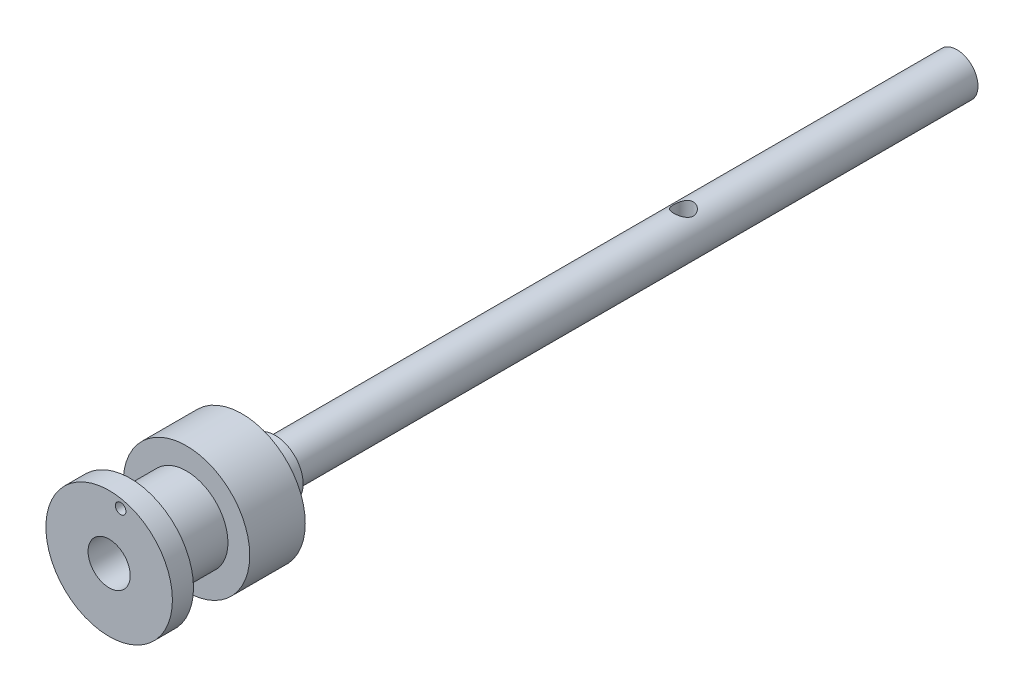
ISO-10303-21;
HEADER;
FILE_DESCRIPTION(('STEP AP214'),'2;1');
FILE_NAME('part.step','',(''),(''),'','','');
FILE_SCHEMA(('AUTOMOTIVE_DESIGN { 1 0 10303 214 1 1 1 1 }'));
ENDSEC;
DATA;
#1=APPLICATION_CONTEXT('core data for automotive mechanical design processes');
#2=APPLICATION_PROTOCOL_DEFINITION('international standard','automotive_design',2000,#1);
#3=PRODUCT_CONTEXT('',#1,'mechanical');
#4=PRODUCT('Part','Part','',(#3));
#5=PRODUCT_RELATED_PRODUCT_CATEGORY('part','',(#4));
#6=PRODUCT_DEFINITION_FORMATION('','',#4);
#7=PRODUCT_DEFINITION_CONTEXT('part definition',#1,'design');
#8=PRODUCT_DEFINITION('design','',#6,#7);
#9=PRODUCT_DEFINITION_SHAPE('','',#8);
#10=(LENGTH_UNIT() NAMED_UNIT(*) SI_UNIT(.MILLI.,.METRE.));
#11=(NAMED_UNIT(*) PLANE_ANGLE_UNIT() SI_UNIT($,.RADIAN.));
#12=(NAMED_UNIT(*) SI_UNIT($,.STERADIAN.) SOLID_ANGLE_UNIT());
#13=UNCERTAINTY_MEASURE_WITH_UNIT(LENGTH_MEASURE(1.E-05),#10,'distance_accuracy_value','');
#14=(GEOMETRIC_REPRESENTATION_CONTEXT(3) GLOBAL_UNCERTAINTY_ASSIGNED_CONTEXT((#13)) GLOBAL_UNIT_ASSIGNED_CONTEXT((#10,
#11,#12)) REPRESENTATION_CONTEXT('',''));
#15=CARTESIAN_POINT('',(0.,0.,0.));
#16=DIRECTION('',(0.,0.,1.));
#17=DIRECTION('',(1.,0.,0.));
#18=AXIS2_PLACEMENT_3D('',#15,#16,#17);
#19=CARTESIAN_POINT('',(0.,0.,97.));
#20=DIRECTION('',(0.,0.,-1.));
#21=DIRECTION('',(-1.,0.,0.));
#22=AXIS2_PLACEMENT_3D('',#19,#20,#21);
#23=CYLINDRICAL_SURFACE('',#22,3.);
#24=CARTESIAN_POINT('',(0.,-3.00000000000001,37.5));
#25=CARTESIAN_POINT('',(0.0741760141958577,-2.99999659855673,37.5000040505541));
#26=CARTESIAN_POINT('',(0.148457438343162,-2.99721866421499,37.5059298208353));
#27=CARTESIAN_POINT('',(0.294860958042644,-2.98638133101226,37.5293877592733));
#28=CARTESIAN_POINT('',(0.366977899485668,-2.97831023303416,37.546945637961));
#29=CARTESIAN_POINT('',(0.506705207958361,-2.95773878056305,37.5928517551339));
#30=CARTESIAN_POINT('',(0.574331184032733,-2.94525483671525,37.6211600432343));
#31=CARTESIAN_POINT('',(0.703790652559763,-2.91703179641225,37.6875743006987));
#32=CARTESIAN_POINT('',(0.765625113804215,-2.90129324579851,37.7256786273952));
#33=CARTESIAN_POINT('',(0.885556018232688,-2.86703510505486,37.8129906836775));
#34=CARTESIAN_POINT('',(0.943262854198603,-2.84841047078529,37.8626918392666));
#35=CARTESIAN_POINT('',(1.04987206669059,-2.81086626705385,37.9707341871541));
#36=CARTESIAN_POINT('',(1.09876864666267,-2.79194651225135,38.0290810220613));
#37=CARTESIAN_POINT('',(1.18954928643586,-2.75454886272565,38.1573436722992));
#38=CARTESIAN_POINT('',(1.23076801131512,-2.73618026181932,38.2277658265075));
#39=CARTESIAN_POINT('',(1.30060459631542,-2.70368671328043,38.3755083341662));
#40=CARTESIAN_POINT('',(1.32923050054668,-2.68955905843085,38.452824245907));
#41=CARTESIAN_POINT('',(1.37136389166293,-2.66831280778357,38.6077086691858));
#42=CARTESIAN_POINT('',(1.38562630954339,-2.66084688805231,38.6850220133979));
#43=CARTESIAN_POINT('',(1.40096431780121,-2.65280653141493,38.8412761554687));
#44=CARTESIAN_POINT('',(1.40205018901381,-2.65222672171534,38.9202156363732));
#45=CARTESIAN_POINT('',(1.39156325474428,-2.6577381391041,39.0689521774073));
#46=CARTESIAN_POINT('',(1.381255487101,-2.66316277668237,39.1388686763252));
#47=CARTESIAN_POINT('',(1.35043639237287,-2.67892103840313,39.2758340783928));
#48=CARTESIAN_POINT('',(1.3299224430034,-2.68925592410991,39.3428822397673));
#49=CARTESIAN_POINT('',(1.27887161255288,-2.71390923378543,39.4740721913311));
#50=CARTESIAN_POINT('',(1.24811450695909,-2.7283140240837,39.5381113040015));
#51=CARTESIAN_POINT('',(1.17761205733664,-2.75947702819645,39.6604059963507));
#52=CARTESIAN_POINT('',(1.1378627854815,-2.77623626923161,39.7186590325906));
#53=CARTESIAN_POINT('',(1.04545769592097,-2.81242518177221,39.8343867427587));
#54=CARTESIAN_POINT('',(0.991869135627395,-2.83194722846672,39.8910901886705));
#55=CARTESIAN_POINT('',(0.875809338201013,-2.86996272516677,39.9950011611005));
#56=CARTESIAN_POINT('',(0.813334864133959,-2.88845579691006,40.0422052120085));
#57=CARTESIAN_POINT('',(0.678420066791924,-2.92314231667083,40.1273252580099));
#58=CARTESIAN_POINT('',(0.605704043903023,-2.9392303997136,40.1648505604658));
#59=CARTESIAN_POINT('',(0.454047875045118,-2.9664385628126,40.2268527185111));
#60=CARTESIAN_POINT('',(0.375112098848916,-2.97756209480586,40.2513386428982));
#61=CARTESIAN_POINT('',(0.219630179590074,-2.99289168727817,40.2847753854863));
#62=CARTESIAN_POINT('',(0.143350867486899,-2.99755511855446,40.2947561577534));
#63=CARTESIAN_POINT('',(-0.00993159603061788,-3.00096130674055,40.3020633399195));
#64=CARTESIAN_POINT('',(-0.0869344549309973,-2.99970636153703,40.2993946611306));
#65=CARTESIAN_POINT('',(-0.23413866230114,-2.99169876992405,40.2821402277437));
#66=CARTESIAN_POINT('',(-0.304455247280257,-2.98531143610107,40.268346120726));
#67=CARTESIAN_POINT('',(-0.441661374952193,-2.9681169868393,40.2304147035299));
#68=CARTESIAN_POINT('',(-0.508550515457679,-2.95730935403884,40.2062761826025));
#69=CARTESIAN_POINT('',(-0.639346310572955,-2.93186182190092,40.1476106001117));
#70=CARTESIAN_POINT('',(-0.703098749779362,-2.91711463217098,40.1127878500144));
#71=CARTESIAN_POINT('',(-0.824081336424183,-2.88527461622476,40.034065572947));
#72=CARTESIAN_POINT('',(-0.881308600637789,-2.86818076040266,39.9901620574598));
#73=CARTESIAN_POINT('',(-0.992927203863405,-2.83157928041133,39.8900494219181));
#74=CARTESIAN_POINT('',(-1.04662821994276,-2.81199150907127,39.8330982533047));
#75=CARTESIAN_POINT('',(-1.14397488618524,-2.7738171204936,39.710822052853));
#76=CARTESIAN_POINT('',(-1.18761573536872,-2.7552309844915,39.6454930459361));
#77=CARTESIAN_POINT('',(-1.26487258942863,-2.72065279755534,39.5055462612367));
#78=CARTESIAN_POINT('',(-1.29811762077689,-2.70476441122083,39.4306959670314));
#79=CARTESIAN_POINT('',(-1.35119476914698,-2.67864935946574,39.2754739377038));
#80=CARTESIAN_POINT('',(-1.37104172650418,-2.6684164320798,39.1951084206029));
#81=CARTESIAN_POINT('',(-1.39512361569359,-2.65589863089785,39.0389244522856));
#82=CARTESIAN_POINT('',(-1.40060458275625,-2.65298045006346,38.9633491392689));
#83=CARTESIAN_POINT('',(-1.39928993042139,-2.65367487263324,38.81234617673));
#84=CARTESIAN_POINT('',(-1.39249775922279,-2.65728564169682,38.7369184916911));
#85=CARTESIAN_POINT('',(-1.36795238910771,-2.66999487603889,38.5940999375163));
#86=CARTESIAN_POINT('',(-1.35103435582631,-2.67867409395688,38.5265240407042));
#87=CARTESIAN_POINT('',(-1.30765598987226,-2.70011439829818,38.3952017153972));
#88=CARTESIAN_POINT('',(-1.28119281477063,-2.71287670048705,38.3314564342173));
#89=CARTESIAN_POINT('',(-1.21748406199402,-2.74208602331761,38.2049634549476));
#90=CARTESIAN_POINT('',(-1.1796403806501,-2.75872111955289,38.1425615223786));
#91=CARTESIAN_POINT('',(-1.0949742620724,-2.79340714138716,38.0246101855588));
#92=CARTESIAN_POINT('',(-1.04814763276814,-2.81145872568485,37.9690640006461));
#93=CARTESIAN_POINT('',(-0.94130768052003,-2.8491150891186,37.8606263800043));
#94=CARTESIAN_POINT('',(-0.880442612871032,-2.86869394428718,37.8085607412822));
#95=CARTESIAN_POINT('',(-0.750199086477076,-2.90547332461736,37.7152565671488));
#96=CARTESIAN_POINT('',(-0.680816600685454,-2.92267271652822,37.6740231823952));
#97=CARTESIAN_POINT('',(-0.535611024288787,-2.95272548252542,37.6040125020167));
#98=CARTESIAN_POINT('',(-0.459824309977943,-2.965601576783,37.5751698583364));
#99=CARTESIAN_POINT('',(-0.303822742627251,-2.98560363061672,37.5309772564507));
#100=CARTESIAN_POINT('',(-0.223621832238218,-2.99274669700571,37.5155871448256));
#101=CARTESIAN_POINT('',(-0.118989792805178,-2.99773444736986,37.5048609854243));
#102=CARTESIAN_POINT('',(-0.0952397688918326,-2.99858232619917,37.5030400999808));
#103=CARTESIAN_POINT('',(-0.0476634596251023,-2.99971565466794,37.50060894435));
#104=CARTESIAN_POINT('',(-0.023837172759726,-3.0000010930864,37.4999986983156));
#105=CARTESIAN_POINT('',(0.,-3.00000000000001,37.5));
#106=B_SPLINE_CURVE_WITH_KNOTS('',3,(#24,#25,#26,#27,#28,#29,#30,#31,#32,#33,#34,#35,#36,#37,
#38,#39,#40,#41,#42,#43,#44,#45,#46,#47,#48,#49,#50,#51,#52,#53,#54,#55,#56,#57,#58,#59,#60,#61,
#62,#63,#64,#65,#66,#67,#68,#69,#70,#71,#72,#73,#74,#75,#76,#77,#78,#79,#80,#81,#82,#83,#84,#85,
#86,#87,#88,#89,#90,#91,#92,#93,#94,#95,#96,#97,#98,#99,#100,#101,#102,#103,#104,#105),
.UNSPECIFIED.,.T.,.F.,(4,2,2,2,2,2,2,2,2,2,2,2,2,2,2,2,2,2,2,2,2,2,2,2,2,2,2,2,2,2,2,2,2,2,2,2,
2,2,2,2,4),(0.,0.222430614227102,0.445354516020346,0.6674579744595,0.889524213319487,
1.12374008349084,1.35810949364731,1.60776429290694,1.85725938392491,2.09282314699249,
2.32820310256044,2.53985531348055,2.75156193252273,2.96815060600376,3.18483406988204,
3.42504393482462,3.66534152788206,3.91419776760518,4.16288070273415,4.39285884216799,
4.62274769694934,4.83758576938905,5.05244899415581,5.27389671638204,5.49544191175845,
5.73644174754948,5.97755635787824,6.2264897623231,6.47514698203738,6.70138965858241,
6.92756878101078,7.13725924988262,7.34701221368887,7.57065894835864,7.79441030722339,
8.04061569917069,8.28693794895592,8.53194466707523,8.77621756163929,8.84769634435319,
8.91917655309539),.UNSPECIFIED.);
#107=CARTESIAN_POINT('',(0.,-3.00000000000001,37.5));
#108=VERTEX_POINT('',#107);
#109=EDGE_CURVE('E55',#108,#108,#106,.T.);
#110=ORIENTED_EDGE('',*,*,#109,.F.);
#111=EDGE_LOOP('',(#110));
#112=FACE_BOUND('',#111,.T.);
#113=CARTESIAN_POINT('',(0.,0.,97.));
#114=DIRECTION('',(0.,0.,1.));
#115=DIRECTION('',(1.,0.,0.));
#116=AXIS2_PLACEMENT_3D('',#113,#114,#115);
#117=CIRCLE('',#116,3.);
#118=CARTESIAN_POINT('',(3.,0.,97.));
#119=VERTEX_POINT('',#118);
#120=EDGE_CURVE('E10',#119,#119,#117,.T.);
#121=ORIENTED_EDGE('',*,*,#120,.F.);
#122=EDGE_LOOP('',(#121));
#123=FACE_BOUND('',#122,.T.);
#124=CARTESIAN_POINT('',(0.,0.,0.));
#125=DIRECTION('',(0.,0.,1.));
#126=DIRECTION('',(1.,0.,0.));
#127=AXIS2_PLACEMENT_3D('',#124,#125,#126);
#128=CIRCLE('',#127,3.);
#129=CARTESIAN_POINT('',(3.,0.,0.));
#130=VERTEX_POINT('',#129);
#131=EDGE_CURVE('E45',#130,#130,#128,.T.);
#132=ORIENTED_EDGE('',*,*,#131,.T.);
#133=EDGE_LOOP('',(#132));
#134=FACE_BOUND('',#133,.T.);
#135=CARTESIAN_POINT('',(0.,2.99999999999999,37.5));
#136=CARTESIAN_POINT('',(-0.0741760141958482,2.99999659855667,37.5000040505541));
#137=CARTESIAN_POINT('',(-0.148457438343153,2.99721866421498,37.5059298208353));
#138=CARTESIAN_POINT('',(-0.294860958042633,2.98638133101227,37.5293877592733));
#139=CARTESIAN_POINT('',(-0.366977899485655,2.97831023303417,37.546945637961));
#140=CARTESIAN_POINT('',(-0.506705207958345,2.95773878056305,37.5928517551339));
#141=CARTESIAN_POINT('',(-0.574331184032716,2.94525483671525,37.6211600432343));
#142=CARTESIAN_POINT('',(-0.703790652559745,2.91703179641225,37.6875743006987));
#143=CARTESIAN_POINT('',(-0.765625113804198,2.90129324579851,37.7256786273952));
#144=CARTESIAN_POINT('',(-0.88555601823267,2.86703510505487,37.8129906836775));
#145=CARTESIAN_POINT('',(-0.943262854198585,2.84841047078529,37.8626918392666));
#146=CARTESIAN_POINT('',(-1.04987206669057,2.81086626705386,37.9707341871541));
#147=CARTESIAN_POINT('',(-1.09876864666265,2.79194651225135,38.0290810220613));
#148=CARTESIAN_POINT('',(-1.18954928643584,2.75454886272566,38.1573436722992));
#149=CARTESIAN_POINT('',(-1.2307680113151,2.73618026181933,38.2277658265075));
#150=CARTESIAN_POINT('',(-1.30060459631541,2.70368671328044,38.3755083341662));
#151=CARTESIAN_POINT('',(-1.32923050054667,2.68955905843086,38.452824245907));
#152=CARTESIAN_POINT('',(-1.37136389166291,2.66831280778357,38.6077086691858));
#153=CARTESIAN_POINT('',(-1.38562630954337,2.66084688805232,38.6850220133979));
#154=CARTESIAN_POINT('',(-1.4009643178012,2.65280653141493,38.8412761554687));
#155=CARTESIAN_POINT('',(-1.4020501890138,2.65222672171534,38.9202156363732));
#156=CARTESIAN_POINT('',(-1.39156325474427,2.6577381391041,39.0689521774073));
#157=CARTESIAN_POINT('',(-1.38125548710099,2.66316277668237,39.1388686763252));
#158=CARTESIAN_POINT('',(-1.35043639237286,2.67892103840314,39.2758340783928));
#159=CARTESIAN_POINT('',(-1.32992244300339,2.68925592410991,39.3428822397672));
#160=CARTESIAN_POINT('',(-1.27887161255287,2.71390923378543,39.4740721913311));
#161=CARTESIAN_POINT('',(-1.24811450695909,2.7283140240837,39.5381113040015));
#162=CARTESIAN_POINT('',(-1.17761205733664,2.75947702819645,39.6604059963507));
#163=CARTESIAN_POINT('',(-1.13786278548148,2.77623626923161,39.7186590325906));
#164=CARTESIAN_POINT('',(-1.04545769592096,2.81242518177222,39.8343867427587));
#165=CARTESIAN_POINT('',(-0.991869135627376,2.83194722846673,39.8910901886705));
#166=CARTESIAN_POINT('',(-0.87580933820099,2.86996272516678,39.9950011611005));
#167=CARTESIAN_POINT('',(-0.813334864133935,2.88845579691007,40.0422052120086));
#168=CARTESIAN_POINT('',(-0.678420066791899,2.92314231667084,40.1273252580099));
#169=CARTESIAN_POINT('',(-0.605704043902998,2.93923039971361,40.1648505604658));
#170=CARTESIAN_POINT('',(-0.454047875045094,2.9664385628126,40.2268527185111));
#171=CARTESIAN_POINT('',(-0.375112098848894,2.97756209480586,40.2513386428982));
#172=CARTESIAN_POINT('',(-0.219630179590053,2.99289168727817,40.2847753854863));
#173=CARTESIAN_POINT('',(-0.143350867486879,2.99755511855446,40.2947561577534));
#174=CARTESIAN_POINT('',(0.00993159603063501,3.00096130674055,40.3020633399195));
#175=CARTESIAN_POINT('',(0.0869344549310127,2.99970636153703,40.2993946611306));
#176=CARTESIAN_POINT('',(0.234138662301153,2.99169876992405,40.2821402277437));
#177=CARTESIAN_POINT('',(0.304455247280268,2.98531143610107,40.268346120726));
#178=CARTESIAN_POINT('',(0.441661374952202,2.9681169868393,40.2304147035299));
#179=CARTESIAN_POINT('',(0.508550515457686,2.95730935403884,40.2062761826025));
#180=CARTESIAN_POINT('',(0.639346310572961,2.93186182190092,40.1476106001117));
#181=CARTESIAN_POINT('',(0.703098749779369,2.91711463217098,40.1127878500144));
#182=CARTESIAN_POINT('',(0.824081336424188,2.88527461622476,40.034065572947));
#183=CARTESIAN_POINT('',(0.881308600637791,2.86818076040266,39.9901620574598));
#184=CARTESIAN_POINT('',(0.992927203863406,2.83157928041133,39.8900494219181));
#185=CARTESIAN_POINT('',(1.04662821994276,2.81199150907127,39.8330982533047));
#186=CARTESIAN_POINT('',(1.14397488618524,2.7738171204936,39.7108220528531));
#187=CARTESIAN_POINT('',(1.18761573536873,2.7552309844915,39.6454930459362));
#188=CARTESIAN_POINT('',(1.26487258942864,2.72065279755534,39.5055462612367));
#189=CARTESIAN_POINT('',(1.2981176207769,2.70476441122083,39.4306959670314));
#190=CARTESIAN_POINT('',(1.35119476914698,2.67864935946574,39.2754739377038));
#191=CARTESIAN_POINT('',(1.37104172650419,2.6684164320798,39.195108420603));
#192=CARTESIAN_POINT('',(1.39512361569359,2.65589863089785,39.0389244522856));
#193=CARTESIAN_POINT('',(1.40060458275626,2.65298045006346,38.9633491392689));
#194=CARTESIAN_POINT('',(1.3992899304214,2.65367487263323,38.81234617673));
#195=CARTESIAN_POINT('',(1.3924977592228,2.65728564169681,38.7369184916911));
#196=CARTESIAN_POINT('',(1.36795238910772,2.66999487603889,38.5940999375163));
#197=CARTESIAN_POINT('',(1.35103435582632,2.67867409395687,38.5265240407042));
#198=CARTESIAN_POINT('',(1.30765598987227,2.70011439829818,38.3952017153972));
#199=CARTESIAN_POINT('',(1.28119281477064,2.71287670048704,38.3314564342173));
#200=CARTESIAN_POINT('',(1.21748406199402,2.7420860233176,38.2049634549476));
#201=CARTESIAN_POINT('',(1.1796403806501,2.75872111955289,38.1425615223786));
#202=CARTESIAN_POINT('',(1.09497426207241,2.79340714138716,38.0246101855587));
#203=CARTESIAN_POINT('',(1.04814763276814,2.81145872568485,37.9690640006461));
#204=CARTESIAN_POINT('',(0.941307680520032,2.8491150891186,37.8606263800043));
#205=CARTESIAN_POINT('',(0.880442612871032,2.86869394428718,37.8085607412822));
#206=CARTESIAN_POINT('',(0.750199086477077,2.90547332461736,37.7152565671488));
#207=CARTESIAN_POINT('',(0.680816600685457,2.92267271652822,37.6740231823952));
#208=CARTESIAN_POINT('',(0.535611024288791,2.95272548252542,37.6040125020167));
#209=CARTESIAN_POINT('',(0.459824309977945,2.96560157678301,37.5751698583364));
#210=CARTESIAN_POINT('',(0.303822742627251,2.98560363061671,37.5309772564507));
#211=CARTESIAN_POINT('',(0.223621832238217,2.99274669700571,37.5155871448256));
#212=CARTESIAN_POINT('',(0.118989792805178,2.99773444736987,37.5048609854243));
#213=CARTESIAN_POINT('',(0.0952397688918344,2.99858232619917,37.5030400999808));
#214=CARTESIAN_POINT('',(0.0476634596251078,2.99971565466793,37.50060894435));
#215=CARTESIAN_POINT('',(0.0238371727597335,3.00000109308638,37.4999986983156));
#216=CARTESIAN_POINT('',(0.,2.99999999999999,37.5));
#217=B_SPLINE_CURVE_WITH_KNOTS('',3,(#135,#136,#137,#138,#139,#140,#141,#142,#143,#144,#145,
#146,#147,#148,#149,#150,#151,#152,#153,#154,#155,#156,#157,#158,#159,#160,#161,#162,#163,#164,
#165,#166,#167,#168,#169,#170,#171,#172,#173,#174,#175,#176,#177,#178,#179,#180,#181,#182,#183,
#184,#185,#186,#187,#188,#189,#190,#191,#192,#193,#194,#195,#196,#197,#198,#199,#200,#201,#202,
#203,#204,#205,#206,#207,#208,#209,#210,#211,#212,#213,#214,#215,#216),.UNSPECIFIED.,.T.,.F.,(4,
2,2,2,2,2,2,2,2,2,2,2,2,2,2,2,2,2,2,2,2,2,2,2,2,2,2,2,2,2,2,2,2,2,2,2,2,2,2,2,4),(0.,
0.222430614227101,0.44535451602034,0.667457974459488,0.889524213319475,1.12374008349083,
1.35810949364729,1.60776429290693,1.85725938392489,2.09282314699247,2.32820310256043,
2.53985531348055,2.75156193252273,2.96815060600375,3.18483406988204,3.42504393482464,
3.66534152788208,3.9141977676052,4.16288070273416,4.392858842168,4.62274769694935,
4.83758576938904,5.0524489941558,5.27389671638203,5.49544191175844,5.73644174754947,
5.97755635787823,6.22648976232309,6.47514698203736,6.7013896585824,6.92756878101077,
7.13725924988262,7.34701221368888,7.57065894835865,7.7944103072234,8.0406156991707,
8.28693794895593,8.53194466707524,8.7762175616393,8.84769634435319,8.91917655309539),.UNSPECIFIED.);
#218=CARTESIAN_POINT('',(0.,2.99999999999999,37.5));
#219=VERTEX_POINT('',#218);
#220=EDGE_CURVE('E38',#219,#219,#217,.T.);
#221=ORIENTED_EDGE('',*,*,#220,.F.);
#222=EDGE_LOOP('',(#221));
#223=FACE_BOUND('',#222,.T.);
#224=ADVANCED_FACE('F34',(#112,#123,#134,#223),#23,.T.);
#225=CARTESIAN_POINT('',(0.,0.,109.6));
#226=DIRECTION('',(0.,0.,1.));
#227=DIRECTION('',(1.,0.,0.));
#228=AXIS2_PLACEMENT_3D('',#225,#226,#227);
#229=PLANE('',#228);
#230=CARTESIAN_POINT('',(0.,0.,109.6));
#231=DIRECTION('',(0.,0.,1.));
#232=DIRECTION('',(1.,0.,0.));
#233=AXIS2_PLACEMENT_3D('',#230,#231,#232);
#234=CIRCLE('',#233,9.);
#235=CARTESIAN_POINT('',(9.,0.,109.6));
#236=VERTEX_POINT('',#235);
#237=EDGE_CURVE('E138',#236,#236,#234,.T.);
#238=ORIENTED_EDGE('',*,*,#237,.T.);
#239=EDGE_LOOP('',(#238));
#240=FACE_BOUND('',#239,.T.);
#241=CARTESIAN_POINT('',(0.,0.,109.6));
#242=DIRECTION('',(0.,0.,1.));
#243=DIRECTION('',(1.,0.,0.));
#244=AXIS2_PLACEMENT_3D('',#241,#242,#243);
#245=CIRCLE('',#244,5.9);
#246=CARTESIAN_POINT('',(5.9,0.,109.6));
#247=VERTEX_POINT('',#246);
#248=EDGE_CURVE('E128',#247,#247,#245,.T.);
#249=ORIENTED_EDGE('',*,*,#248,.F.);
#250=EDGE_LOOP('',(#249));
#251=FACE_BOUND('',#250,.T.);
#252=ADVANCED_FACE('F86',(#240,#251),#229,.T.);
#253=CARTESIAN_POINT('',(0.,0.,0.));
#254=DIRECTION('',(0.,0.,1.));
#255=DIRECTION('',(1.,0.,0.));
#256=AXIS2_PLACEMENT_3D('',#253,#254,#255);
#257=PLANE('',#256);
#258=ORIENTED_EDGE('',*,*,#131,.F.);
#259=EDGE_LOOP('',(#258));
#260=FACE_BOUND('',#259,.T.);
#261=ADVANCED_FACE('F89',(#260),#257,.F.);
#262=CARTESIAN_POINT('',(0.,0.,97.));
#263=DIRECTION('',(0.,0.,1.));
#264=DIRECTION('',(1.,0.,0.));
#265=AXIS2_PLACEMENT_3D('',#262,#263,#264);
#266=PLANE('',#265);
#267=CARTESIAN_POINT('',(0.,0.,97.));
#268=DIRECTION('',(0.,0.,1.));
#269=DIRECTION('',(1.,0.,0.));
#270=AXIS2_PLACEMENT_3D('',#267,#268,#269);
#271=CIRCLE('',#270,4.);
#272=CARTESIAN_POINT('',(4.,0.,97.));
#273=VERTEX_POINT('',#272);
#274=EDGE_CURVE('E53',#273,#273,#271,.T.);
#275=ORIENTED_EDGE('',*,*,#274,.F.);
#276=EDGE_LOOP('',(#275));
#277=FACE_BOUND('',#276,.T.);
#278=ORIENTED_EDGE('',*,*,#120,.T.);
#279=EDGE_LOOP('',(#278));
#280=FACE_BOUND('',#279,.T.);
#281=ADVANCED_FACE('F99',(#277,#280),#266,.F.);
#282=CARTESIAN_POINT('',(0.,0.,101.7));
#283=DIRECTION('',(0.,0.,-1.));
#284=DIRECTION('',(-1.,0.,0.));
#285=AXIS2_PLACEMENT_3D('',#282,#283,#284);
#286=CYLINDRICAL_SURFACE('',#285,4.);
#287=CARTESIAN_POINT('',(0.,0.,101.7));
#288=DIRECTION('',(0.,0.,1.));
#289=DIRECTION('',(1.,0.,0.));
#290=AXIS2_PLACEMENT_3D('',#287,#288,#289);
#291=CIRCLE('',#290,4.);
#292=CARTESIAN_POINT('',(4.,0.,101.7));
#293=VERTEX_POINT('',#292);
#294=EDGE_CURVE('E50',#293,#293,#291,.T.);
#295=ORIENTED_EDGE('',*,*,#294,.F.);
#296=EDGE_LOOP('',(#295));
#297=FACE_BOUND('',#296,.T.);
#298=ORIENTED_EDGE('',*,*,#274,.T.);
#299=EDGE_LOOP('',(#298));
#300=FACE_BOUND('',#299,.T.);
#301=ADVANCED_FACE('F94',(#297,#300),#286,.T.);
#302=CARTESIAN_POINT('',(0.,0.,101.7));
#303=DIRECTION('',(0.,0.,1.));
#304=DIRECTION('',(1.,0.,0.));
#305=AXIS2_PLACEMENT_3D('',#302,#303,#304);
#306=PLANE('',#305);
#307=CARTESIAN_POINT('',(0.,0.,101.7));
#308=DIRECTION('',(0.,0.,1.));
#309=DIRECTION('',(1.,0.,0.));
#310=AXIS2_PLACEMENT_3D('',#307,#308,#309);
#311=CIRCLE('',#310,9.);
#312=CARTESIAN_POINT('',(9.,0.,101.7));
#313=VERTEX_POINT('',#312);
#314=EDGE_CURVE('E135',#313,#313,#311,.T.);
#315=ORIENTED_EDGE('',*,*,#314,.F.);
#316=EDGE_LOOP('',(#315));
#317=FACE_BOUND('',#316,.T.);
#318=ORIENTED_EDGE('',*,*,#294,.T.);
#319=EDGE_LOOP('',(#318));
#320=FACE_BOUND('',#319,.T.);
#321=ADVANCED_FACE('F91',(#317,#320),#306,.F.);
#322=CARTESIAN_POINT('',(0.,0.,109.6));
#323=DIRECTION('',(0.,0.,-1.));
#324=DIRECTION('',(-1.,0.,0.));
#325=AXIS2_PLACEMENT_3D('',#322,#323,#324);
#326=CYLINDRICAL_SURFACE('',#325,9.);
#327=ORIENTED_EDGE('',*,*,#237,.F.);
#328=EDGE_LOOP('',(#327));
#329=FACE_BOUND('',#328,.T.);
#330=ORIENTED_EDGE('',*,*,#314,.T.);
#331=EDGE_LOOP('',(#330));
#332=FACE_BOUND('',#331,.T.);
#333=ADVANCED_FACE('F84',(#329,#332),#326,.T.);
#334=CARTESIAN_POINT('',(0.,0.,117.6));
#335=DIRECTION('',(0.,0.,-1.));
#336=DIRECTION('',(-1.,0.,0.));
#337=AXIS2_PLACEMENT_3D('',#334,#335,#336);
#338=CYLINDRICAL_SURFACE('',#337,5.9);
#339=CARTESIAN_POINT('',(0.,0.,117.6));
#340=DIRECTION('',(0.,0.,1.));
#341=DIRECTION('',(1.,0.,0.));
#342=AXIS2_PLACEMENT_3D('',#339,#340,#341);
#343=CIRCLE('',#342,5.9);
#344=CARTESIAN_POINT('',(5.9,0.,117.6));
#345=VERTEX_POINT('',#344);
#346=EDGE_CURVE('E132',#345,#345,#343,.T.);
#347=ORIENTED_EDGE('',*,*,#346,.F.);
#348=EDGE_LOOP('',(#347));
#349=FACE_BOUND('',#348,.T.);
#350=ORIENTED_EDGE('',*,*,#248,.T.);
#351=EDGE_LOOP('',(#350));
#352=FACE_BOUND('',#351,.T.);
#353=ADVANCED_FACE('F77',(#349,#352),#338,.T.);
#354=CARTESIAN_POINT('',(0.,0.,117.6));
#355=DIRECTION('',(0.,0.,1.));
#356=DIRECTION('',(1.,0.,0.));
#357=AXIS2_PLACEMENT_3D('',#354,#355,#356);
#358=PLANE('',#357);
#359=CARTESIAN_POINT('',(1.63775133757756,7.5882478641098,117.6));
#360=DIRECTION('',(0.,0.,1.));
#361=DIRECTION('',(1.,0.,0.));
#362=AXIS2_PLACEMENT_3D('',#359,#360,#361);
#363=CIRCLE('',#362,0.75);
#364=CARTESIAN_POINT('',(2.38775133757756,7.5882478641098,117.6));
#365=VERTEX_POINT('',#364);
#366=EDGE_CURVE('E159',#365,#365,#363,.T.);
#367=ORIENTED_EDGE('',*,*,#366,.T.);
#368=EDGE_LOOP('',(#367));
#369=FACE_BOUND('',#368,.T.);
#370=CARTESIAN_POINT('',(0.,0.,117.6));
#371=DIRECTION('',(0.,0.,1.));
#372=DIRECTION('',(1.,0.,0.));
#373=AXIS2_PLACEMENT_3D('',#370,#371,#372);
#374=CIRCLE('',#373,9.);
#375=CARTESIAN_POINT('',(9.,0.,117.6));
#376=VERTEX_POINT('',#375);
#377=EDGE_CURVE('E121',#376,#376,#374,.T.);
#378=ORIENTED_EDGE('',*,*,#377,.F.);
#379=EDGE_LOOP('',(#378));
#380=FACE_BOUND('',#379,.T.);
#381=ORIENTED_EDGE('',*,*,#346,.T.);
#382=EDGE_LOOP('',(#381));
#383=FACE_BOUND('',#382,.T.);
#384=ADVANCED_FACE('F74',(#369,#380,#383),#358,.F.);
#385=CARTESIAN_POINT('',(0.,0.,120.6));
#386=DIRECTION('',(0.,0.,-1.));
#387=DIRECTION('',(-1.,0.,0.));
#388=AXIS2_PLACEMENT_3D('',#385,#386,#387);
#389=CYLINDRICAL_SURFACE('',#388,9.);
#390=CARTESIAN_POINT('',(0.,0.,120.6));
#391=DIRECTION('',(0.,0.,1.));
#392=DIRECTION('',(1.,0.,0.));
#393=AXIS2_PLACEMENT_3D('',#390,#391,#392);
#394=CIRCLE('',#393,9.);
#395=CARTESIAN_POINT('',(9.,0.,120.6));
#396=VERTEX_POINT('',#395);
#397=EDGE_CURVE('E123',#396,#396,#394,.T.);
#398=ORIENTED_EDGE('',*,*,#397,.F.);
#399=EDGE_LOOP('',(#398));
#400=FACE_BOUND('',#399,.T.);
#401=ORIENTED_EDGE('',*,*,#377,.T.);
#402=EDGE_LOOP('',(#401));
#403=FACE_BOUND('',#402,.T.);
#404=ADVANCED_FACE('F72',(#400,#403),#389,.T.);
#405=CARTESIAN_POINT('',(0.,0.,120.6));
#406=DIRECTION('',(0.,0.,1.));
#407=DIRECTION('',(1.,0.,0.));
#408=AXIS2_PLACEMENT_3D('',#405,#406,#407);
#409=PLANE('',#408);
#410=CARTESIAN_POINT('',(1.63775133757756,7.5882478641098,120.6));
#411=DIRECTION('',(0.,0.,1.));
#412=DIRECTION('',(1.,0.,0.));
#413=AXIS2_PLACEMENT_3D('',#410,#411,#412);
#414=CIRCLE('',#413,0.75);
#415=CARTESIAN_POINT('',(2.38775133757756,7.5882478641098,120.6));
#416=VERTEX_POINT('',#415);
#417=EDGE_CURVE('E164',#416,#416,#414,.T.);
#418=ORIENTED_EDGE('',*,*,#417,.F.);
#419=EDGE_LOOP('',(#418));
#420=FACE_BOUND('',#419,.T.);
#421=CARTESIAN_POINT('',(0.,0.,120.6));
#422=DIRECTION('',(0.,0.,1.));
#423=DIRECTION('',(1.,0.,0.));
#424=AXIS2_PLACEMENT_3D('',#421,#422,#423);
#425=CIRCLE('',#424,3.);
#426=CARTESIAN_POINT('',(3.,0.,120.6));
#427=VERTEX_POINT('',#426);
#428=EDGE_CURVE('E156',#427,#427,#425,.T.);
#429=ORIENTED_EDGE('',*,*,#428,.F.);
#430=EDGE_LOOP('',(#429));
#431=FACE_BOUND('',#430,.T.);
#432=ORIENTED_EDGE('',*,*,#397,.T.);
#433=EDGE_LOOP('',(#432));
#434=FACE_BOUND('',#433,.T.);
#435=ADVANCED_FACE('F66',(#420,#431,#434),#409,.T.);
#436=CARTESIAN_POINT('',(0.,82.,38.9));
#437=DIRECTION('',(0.,-1.,0.));
#438=DIRECTION('',(0.,0.,-1.));
#439=AXIS2_PLACEMENT_3D('',#436,#437,#438);
#440=CYLINDRICAL_SURFACE('',#439,1.4);
#441=ORIENTED_EDGE('',*,*,#109,.T.);
#442=EDGE_LOOP('',(#441));
#443=FACE_BOUND('',#442,.T.);
#444=ORIENTED_EDGE('',*,*,#220,.T.);
#445=EDGE_LOOP('',(#444));
#446=FACE_BOUND('',#445,.T.);
#447=ADVANCED_FACE('F60',(#443,#446),#440,.F.);
#448=CARTESIAN_POINT('',(0.,0.,111.6));
#449=DIRECTION('',(0.,0.,1.));
#450=DIRECTION('',(1.,0.,0.));
#451=AXIS2_PLACEMENT_3D('',#448,#449,#450);
#452=CYLINDRICAL_SURFACE('',#451,3.);
#453=CARTESIAN_POINT('',(0.,0.,111.6));
#454=DIRECTION('',(0.,0.,1.));
#455=DIRECTION('',(1.,0.,0.));
#456=AXIS2_PLACEMENT_3D('',#453,#454,#455);
#457=CIRCLE('',#456,3.);
#458=CARTESIAN_POINT('',(3.,0.,111.6));
#459=VERTEX_POINT('',#458);
#460=EDGE_CURVE('E59',#459,#459,#457,.T.);
#461=ORIENTED_EDGE('',*,*,#460,.F.);
#462=EDGE_LOOP('',(#461));
#463=FACE_BOUND('',#462,.T.);
#464=ORIENTED_EDGE('',*,*,#428,.T.);
#465=EDGE_LOOP('',(#464));
#466=FACE_BOUND('',#465,.T.);
#467=ADVANCED_FACE('F65',(#463,#466),#452,.F.);
#468=CARTESIAN_POINT('',(0.,0.,111.6));
#469=DIRECTION('',(0.,0.,1.));
#470=DIRECTION('',(1.,0.,0.));
#471=AXIS2_PLACEMENT_3D('',#468,#469,#470);
#472=PLANE('',#471);
#473=ORIENTED_EDGE('',*,*,#460,.T.);
#474=EDGE_LOOP('',(#473));
#475=FACE_BOUND('',#474,.T.);
#476=ADVANCED_FACE('F176',(#475),#472,.T.);
#477=CARTESIAN_POINT('',(1.63775133757756,7.5882478641098,111.6));
#478=DIRECTION('',(0.,0.,1.));
#479=DIRECTION('',(1.,0.,0.));
#480=AXIS2_PLACEMENT_3D('',#477,#478,#479);
#481=CYLINDRICAL_SURFACE('',#480,0.75);
#482=ORIENTED_EDGE('',*,*,#417,.T.);
#483=EDGE_LOOP('',(#482));
#484=FACE_BOUND('',#483,.T.);
#485=ORIENTED_EDGE('',*,*,#366,.F.);
#486=EDGE_LOOP('',(#485));
#487=FACE_BOUND('',#486,.T.);
#488=ADVANCED_FACE('F168',(#484,#487),#481,.F.);
#489=CLOSED_SHELL('',(#224,#252,#261,#281,#301,#321,#333,#353,#384,#404,#435,#447,#467,#476,#488));
#490=MANIFOLD_SOLID_BREP('B2',#489);
#491=ADVANCED_BREP_SHAPE_REPRESENTATION('',(#18,#490),#14);
#492=SHAPE_DEFINITION_REPRESENTATION(#9,#491);
ENDSEC;
END-ISO-10303-21;
